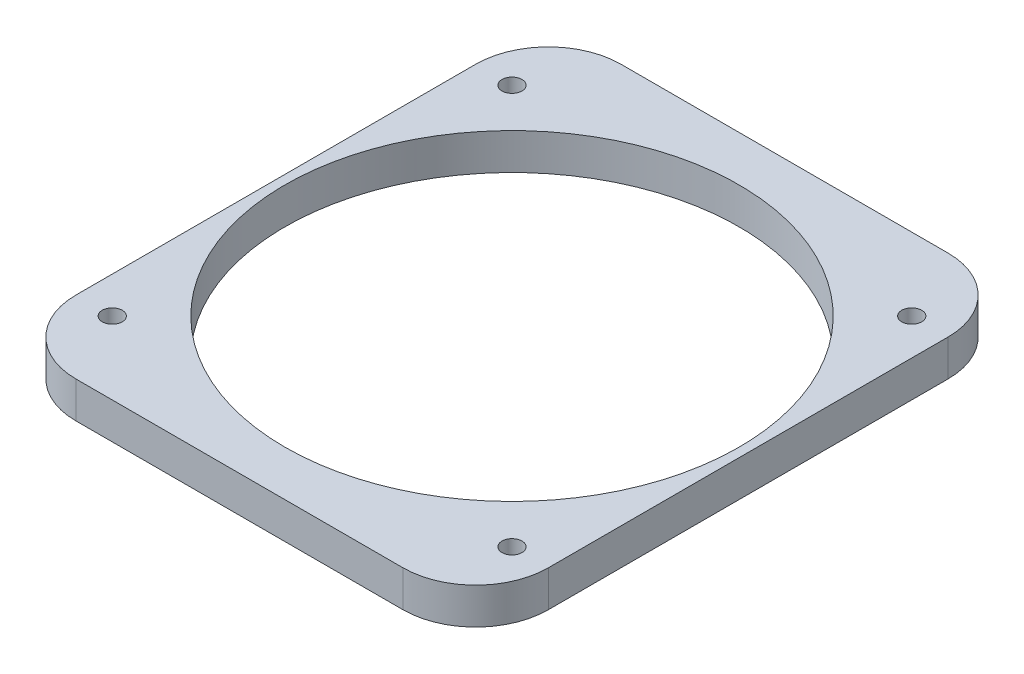
ISO-10303-21;
HEADER;
FILE_DESCRIPTION(('STEP AP214'),'2;1');
FILE_NAME('part.step','',(''),(''),'','','');
FILE_SCHEMA(('AUTOMOTIVE_DESIGN { 1 0 10303 214 1 1 1 1 }'));
ENDSEC;
DATA;
#1=APPLICATION_CONTEXT('core data for automotive mechanical design processes');
#2=APPLICATION_PROTOCOL_DEFINITION('international standard','automotive_design',2000,#1);
#3=PRODUCT_CONTEXT('',#1,'mechanical');
#4=PRODUCT('Part','Part','',(#3));
#5=PRODUCT_RELATED_PRODUCT_CATEGORY('part','',(#4));
#6=PRODUCT_DEFINITION_FORMATION('','',#4);
#7=PRODUCT_DEFINITION_CONTEXT('part definition',#1,'design');
#8=PRODUCT_DEFINITION('design','',#6,#7);
#9=PRODUCT_DEFINITION_SHAPE('','',#8);
#10=(LENGTH_UNIT() NAMED_UNIT(*) SI_UNIT(.MILLI.,.METRE.));
#11=(NAMED_UNIT(*) PLANE_ANGLE_UNIT() SI_UNIT($,.RADIAN.));
#12=(NAMED_UNIT(*) SI_UNIT($,.STERADIAN.) SOLID_ANGLE_UNIT());
#13=UNCERTAINTY_MEASURE_WITH_UNIT(LENGTH_MEASURE(1.E-05),#10,'distance_accuracy_value','');
#14=(GEOMETRIC_REPRESENTATION_CONTEXT(3) GLOBAL_UNCERTAINTY_ASSIGNED_CONTEXT((#13)) GLOBAL_UNIT_ASSIGNED_CONTEXT((#10,
#11,#12)) REPRESENTATION_CONTEXT('',''));
#15=CARTESIAN_POINT('',(0.,0.,0.));
#16=DIRECTION('',(0.,0.,1.));
#17=DIRECTION('',(1.,0.,0.));
#18=AXIS2_PLACEMENT_3D('',#15,#16,#17);
#19=CARTESIAN_POINT('',(0.,6.35,0.));
#20=DIRECTION('',(0.,1.,0.));
#21=DIRECTION('',(0.,0.,1.));
#22=AXIS2_PLACEMENT_3D('',#19,#20,#21);
#23=PLANE('',#22);
#24=CARTESIAN_POINT('',(0.,6.35,0.));
#25=DIRECTION('',(0.,1.,0.));
#26=DIRECTION('',(0.,0.,1.));
#27=AXIS2_PLACEMENT_3D('',#24,#25,#26);
#28=CIRCLE('',#27,39.6875);
#29=CARTESIAN_POINT('',(0.,6.35,39.6875));
#30=VERTEX_POINT('',#29);
#31=EDGE_CURVE('E201',#30,#30,#28,.T.);
#32=ORIENTED_EDGE('',*,*,#31,.F.);
#33=EDGE_LOOP('',(#32));
#34=FACE_BOUND('',#33,.T.);
#35=CARTESIAN_POINT('',(34.925,6.35,34.925));
#36=DIRECTION('',(0.,1.,0.));
#37=DIRECTION('',(0.,0.,1.));
#38=AXIS2_PLACEMENT_3D('',#35,#36,#37);
#39=CIRCLE('',#38,1.75);
#40=CARTESIAN_POINT('',(34.925,6.35,36.675));
#41=VERTEX_POINT('',#40);
#42=EDGE_CURVE('E186',#41,#41,#39,.T.);
#43=ORIENTED_EDGE('',*,*,#42,.F.);
#44=EDGE_LOOP('',(#43));
#45=FACE_BOUND('',#44,.T.);
#46=CARTESIAN_POINT('',(-34.925,6.35,-34.925));
#47=DIRECTION('',(0.,1.,0.));
#48=DIRECTION('',(0.,0.,1.));
#49=AXIS2_PLACEMENT_3D('',#46,#47,#48);
#50=CIRCLE('',#49,1.75);
#51=CARTESIAN_POINT('',(-34.925,6.35,-33.175));
#52=VERTEX_POINT('',#51);
#53=EDGE_CURVE('E127',#52,#52,#50,.T.);
#54=ORIENTED_EDGE('',*,*,#53,.F.);
#55=EDGE_LOOP('',(#54));
#56=FACE_BOUND('',#55,.T.);
#57=DIRECTION('',(-1.,0.,0.));
#58=VECTOR('',#57,1.);
#59=CARTESIAN_POINT('',(41.275,6.35,-47.625));
#60=LINE('',#59,#58);
#61=CARTESIAN_POINT('',(28.575,6.35,-47.625));
#62=VERTEX_POINT('',#61);
#63=CARTESIAN_POINT('',(-28.575,6.35,-47.625));
#64=VERTEX_POINT('',#63);
#65=EDGE_CURVE('E136',#62,#64,#60,.T.);
#66=ORIENTED_EDGE('',*,*,#65,.T.);
#67=CARTESIAN_POINT('',(-28.575,6.35,-34.925));
#68=DIRECTION('',(0.,1.,0.));
#69=DIRECTION('',(0.,0.,1.));
#70=AXIS2_PLACEMENT_3D('',#67,#68,#69);
#71=CIRCLE('',#70,12.7);
#72=CARTESIAN_POINT('',(-41.275,6.35,-34.925));
#73=VERTEX_POINT('',#72);
#74=EDGE_CURVE('E155',#64,#73,#71,.T.);
#75=ORIENTED_EDGE('',*,*,#74,.T.);
#76=DIRECTION('',(0.,0.,1.));
#77=VECTOR('',#76,1.);
#78=CARTESIAN_POINT('',(-41.275,6.35,47.625));
#79=LINE('',#78,#77);
#80=CARTESIAN_POINT('',(-41.275,6.35,34.925));
#81=VERTEX_POINT('',#80);
#82=EDGE_CURVE('E119',#73,#81,#79,.T.);
#83=ORIENTED_EDGE('',*,*,#82,.T.);
#84=CARTESIAN_POINT('',(-28.575,6.35,34.925));
#85=DIRECTION('',(0.,1.,0.));
#86=DIRECTION('',(0.,0.,1.));
#87=AXIS2_PLACEMENT_3D('',#84,#85,#86);
#88=CIRCLE('',#87,12.7);
#89=CARTESIAN_POINT('',(-28.575,6.35,47.625));
#90=VERTEX_POINT('',#89);
#91=EDGE_CURVE('E150',#81,#90,#88,.T.);
#92=ORIENTED_EDGE('',*,*,#91,.T.);
#93=DIRECTION('',(1.,0.,0.));
#94=VECTOR('',#93,1.);
#95=CARTESIAN_POINT('',(41.275,6.35,47.625));
#96=LINE('',#95,#94);
#97=CARTESIAN_POINT('',(28.575,6.35,47.625));
#98=VERTEX_POINT('',#97);
#99=EDGE_CURVE('E166',#90,#98,#96,.T.);
#100=ORIENTED_EDGE('',*,*,#99,.T.);
#101=CARTESIAN_POINT('',(28.575,6.35,34.925));
#102=DIRECTION('',(0.,1.,0.));
#103=DIRECTION('',(0.,0.,1.));
#104=AXIS2_PLACEMENT_3D('',#101,#102,#103);
#105=CIRCLE('',#104,12.7);
#106=CARTESIAN_POINT('',(41.275,6.35,34.925));
#107=VERTEX_POINT('',#106);
#108=EDGE_CURVE('E55',#98,#107,#105,.T.);
#109=ORIENTED_EDGE('',*,*,#108,.T.);
#110=DIRECTION('',(0.,0.,-1.));
#111=VECTOR('',#110,1.);
#112=CARTESIAN_POINT('',(41.275,6.35,47.625));
#113=LINE('',#112,#111);
#114=CARTESIAN_POINT('',(41.275,6.35,-34.925));
#115=VERTEX_POINT('',#114);
#116=EDGE_CURVE('E174',#107,#115,#113,.T.);
#117=ORIENTED_EDGE('',*,*,#116,.T.);
#118=CARTESIAN_POINT('',(28.575,6.35,-34.925));
#119=DIRECTION('',(0.,1.,0.));
#120=DIRECTION('',(0.,0.,1.));
#121=AXIS2_PLACEMENT_3D('',#118,#119,#120);
#122=CIRCLE('',#121,12.7);
#123=EDGE_CURVE('E153',#115,#62,#122,.T.);
#124=ORIENTED_EDGE('',*,*,#123,.T.);
#125=EDGE_LOOP('',(#66,#75,#83,#92,#100,#109,#117,#124));
#126=FACE_BOUND('',#125,.T.);
#127=CARTESIAN_POINT('',(-34.925,6.35,34.925));
#128=DIRECTION('',(0.,1.,0.));
#129=DIRECTION('',(0.,0.,1.));
#130=AXIS2_PLACEMENT_3D('',#127,#128,#129);
#131=CIRCLE('',#130,1.75);
#132=CARTESIAN_POINT('',(-34.925,6.35,36.675));
#133=VERTEX_POINT('',#132);
#134=EDGE_CURVE('E181',#133,#133,#131,.T.);
#135=ORIENTED_EDGE('',*,*,#134,.F.);
#136=EDGE_LOOP('',(#135));
#137=FACE_BOUND('',#136,.T.);
#138=CARTESIAN_POINT('',(34.925,6.35,-34.925));
#139=DIRECTION('',(0.,1.,0.));
#140=DIRECTION('',(0.,0.,1.));
#141=AXIS2_PLACEMENT_3D('',#138,#139,#140);
#142=CIRCLE('',#141,1.75);
#143=CARTESIAN_POINT('',(34.925,6.35,-33.175));
#144=VERTEX_POINT('',#143);
#145=EDGE_CURVE('E192',#144,#144,#142,.T.);
#146=ORIENTED_EDGE('',*,*,#145,.F.);
#147=EDGE_LOOP('',(#146));
#148=FACE_BOUND('',#147,.T.);
#149=ADVANCED_FACE('F33',(#34,#45,#56,#126,#137,#148),#23,.T.);
#150=CARTESIAN_POINT('',(0.,0.,0.));
#151=DIRECTION('',(0.,1.,0.));
#152=DIRECTION('',(0.,0.,1.));
#153=AXIS2_PLACEMENT_3D('',#150,#151,#152);
#154=PLANE('',#153);
#155=CARTESIAN_POINT('',(0.,0.,0.));
#156=DIRECTION('',(0.,1.,0.));
#157=DIRECTION('',(0.,0.,1.));
#158=AXIS2_PLACEMENT_3D('',#155,#156,#157);
#159=CIRCLE('',#158,39.6875);
#160=CARTESIAN_POINT('',(0.,0.,39.6875));
#161=VERTEX_POINT('',#160);
#162=EDGE_CURVE('E198',#161,#161,#159,.T.);
#163=ORIENTED_EDGE('',*,*,#162,.T.);
#164=EDGE_LOOP('',(#163));
#165=FACE_BOUND('',#164,.T.);
#166=CARTESIAN_POINT('',(34.925,0.,34.925));
#167=DIRECTION('',(0.,1.,0.));
#168=DIRECTION('',(0.,0.,1.));
#169=AXIS2_PLACEMENT_3D('',#166,#167,#168);
#170=CIRCLE('',#169,1.75);
#171=CARTESIAN_POINT('',(34.925,0.,36.675));
#172=VERTEX_POINT('',#171);
#173=EDGE_CURVE('E189',#172,#172,#170,.T.);
#174=ORIENTED_EDGE('',*,*,#173,.T.);
#175=EDGE_LOOP('',(#174));
#176=FACE_BOUND('',#175,.T.);
#177=CARTESIAN_POINT('',(-34.925,0.,-34.925));
#178=DIRECTION('',(0.,1.,0.));
#179=DIRECTION('',(0.,0.,1.));
#180=AXIS2_PLACEMENT_3D('',#177,#178,#179);
#181=CIRCLE('',#180,1.75);
#182=CARTESIAN_POINT('',(-34.925,0.,-33.175));
#183=VERTEX_POINT('',#182);
#184=EDGE_CURVE('E133',#183,#183,#181,.T.);
#185=ORIENTED_EDGE('',*,*,#184,.T.);
#186=EDGE_LOOP('',(#185));
#187=FACE_BOUND('',#186,.T.);
#188=DIRECTION('',(0.,0.,1.));
#189=VECTOR('',#188,1.);
#190=CARTESIAN_POINT('',(-41.275,0.,47.625));
#191=LINE('',#190,#189);
#192=CARTESIAN_POINT('',(-41.275,0.,-34.925));
#193=VERTEX_POINT('',#192);
#194=CARTESIAN_POINT('',(-41.275,0.,34.925));
#195=VERTEX_POINT('',#194);
#196=EDGE_CURVE('E116',#193,#195,#191,.T.);
#197=ORIENTED_EDGE('',*,*,#196,.F.);
#198=CARTESIAN_POINT('',(-28.575,0.,-34.925));
#199=DIRECTION('',(0.,1.,0.));
#200=DIRECTION('',(0.,0.,1.));
#201=AXIS2_PLACEMENT_3D('',#198,#199,#200);
#202=CIRCLE('',#201,12.7);
#203=CARTESIAN_POINT('',(-28.575,0.,-47.625));
#204=VERTEX_POINT('',#203);
#205=EDGE_CURVE('E99',#193,#204,#202,.F.);
#206=ORIENTED_EDGE('',*,*,#205,.T.);
#207=DIRECTION('',(-1.,0.,0.));
#208=VECTOR('',#207,1.);
#209=CARTESIAN_POINT('',(41.275,0.,-47.625));
#210=LINE('',#209,#208);
#211=CARTESIAN_POINT('',(28.575,0.,-47.625));
#212=VERTEX_POINT('',#211);
#213=EDGE_CURVE('E140',#212,#204,#210,.T.);
#214=ORIENTED_EDGE('',*,*,#213,.F.);
#215=CARTESIAN_POINT('',(28.575,0.,-34.925));
#216=DIRECTION('',(0.,1.,0.));
#217=DIRECTION('',(0.,0.,1.));
#218=AXIS2_PLACEMENT_3D('',#215,#216,#217);
#219=CIRCLE('',#218,12.7);
#220=CARTESIAN_POINT('',(41.275,0.,-34.925));
#221=VERTEX_POINT('',#220);
#222=EDGE_CURVE('E110',#212,#221,#219,.F.);
#223=ORIENTED_EDGE('',*,*,#222,.T.);
#224=DIRECTION('',(0.,0.,-1.));
#225=VECTOR('',#224,1.);
#226=CARTESIAN_POINT('',(41.275,0.,47.625));
#227=LINE('',#226,#225);
#228=CARTESIAN_POINT('',(41.275,0.,34.925));
#229=VERTEX_POINT('',#228);
#230=EDGE_CURVE('E130',#229,#221,#227,.T.);
#231=ORIENTED_EDGE('',*,*,#230,.F.);
#232=CARTESIAN_POINT('',(28.575,0.,34.925));
#233=DIRECTION('',(0.,1.,0.));
#234=DIRECTION('',(0.,0.,1.));
#235=AXIS2_PLACEMENT_3D('',#232,#233,#234);
#236=CIRCLE('',#235,12.7);
#237=CARTESIAN_POINT('',(28.575,0.,47.625));
#238=VERTEX_POINT('',#237);
#239=EDGE_CURVE('E144',#229,#238,#236,.F.);
#240=ORIENTED_EDGE('',*,*,#239,.T.);
#241=DIRECTION('',(1.,0.,0.));
#242=VECTOR('',#241,1.);
#243=CARTESIAN_POINT('',(41.275,0.,47.625));
#244=LINE('',#243,#242);
#245=CARTESIAN_POINT('',(-28.575,0.,47.625));
#246=VERTEX_POINT('',#245);
#247=EDGE_CURVE('E126',#246,#238,#244,.T.);
#248=ORIENTED_EDGE('',*,*,#247,.F.);
#249=CARTESIAN_POINT('',(-28.575,0.,34.925));
#250=DIRECTION('',(0.,1.,0.));
#251=DIRECTION('',(0.,0.,1.));
#252=AXIS2_PLACEMENT_3D('',#249,#250,#251);
#253=CIRCLE('',#252,12.7);
#254=EDGE_CURVE('E120',#246,#195,#253,.F.);
#255=ORIENTED_EDGE('',*,*,#254,.T.);
#256=EDGE_LOOP('',(#197,#206,#214,#223,#231,#240,#248,#255));
#257=FACE_BOUND('',#256,.T.);
#258=CARTESIAN_POINT('',(-34.925,0.,34.925));
#259=DIRECTION('',(0.,1.,0.));
#260=DIRECTION('',(0.,0.,1.));
#261=AXIS2_PLACEMENT_3D('',#258,#259,#260);
#262=CIRCLE('',#261,1.75);
#263=CARTESIAN_POINT('',(-34.925,0.,36.675));
#264=VERTEX_POINT('',#263);
#265=EDGE_CURVE('E183',#264,#264,#262,.T.);
#266=ORIENTED_EDGE('',*,*,#265,.T.);
#267=EDGE_LOOP('',(#266));
#268=FACE_BOUND('',#267,.T.);
#269=CARTESIAN_POINT('',(34.925,0.,-34.925));
#270=DIRECTION('',(0.,1.,0.));
#271=DIRECTION('',(0.,0.,1.));
#272=AXIS2_PLACEMENT_3D('',#269,#270,#271);
#273=CIRCLE('',#272,1.75);
#274=CARTESIAN_POINT('',(34.925,0.,-33.175));
#275=VERTEX_POINT('',#274);
#276=EDGE_CURVE('E195',#275,#275,#273,.T.);
#277=ORIENTED_EDGE('',*,*,#276,.T.);
#278=EDGE_LOOP('',(#277));
#279=FACE_BOUND('',#278,.T.);
#280=ADVANCED_FACE('F123',(#165,#176,#187,#257,#268,#279),#154,.F.);
#281=CARTESIAN_POINT('',(-41.275,6.35,47.625));
#282=DIRECTION('',(1.,0.,0.));
#283=DIRECTION('',(0.,0.,-1.));
#284=AXIS2_PLACEMENT_3D('',#281,#282,#283);
#285=PLANE('',#284);
#286=ORIENTED_EDGE('',*,*,#82,.F.);
#287=DIRECTION('',(0.,-1.,0.));
#288=VECTOR('',#287,1.);
#289=CARTESIAN_POINT('',(-41.275,6.35,-34.925));
#290=LINE('',#289,#288);
#291=EDGE_CURVE('E103',#73,#193,#290,.T.);
#292=ORIENTED_EDGE('',*,*,#291,.T.);
#293=ORIENTED_EDGE('',*,*,#196,.T.);
#294=DIRECTION('',(0.,-1.,0.));
#295=VECTOR('',#294,1.);
#296=CARTESIAN_POINT('',(-41.275,6.35,34.925));
#297=LINE('',#296,#295);
#298=EDGE_CURVE('E121',#195,#81,#297,.F.);
#299=ORIENTED_EDGE('',*,*,#298,.T.);
#300=EDGE_LOOP('',(#286,#292,#293,#299));
#301=FACE_BOUND('',#300,.T.);
#302=ADVANCED_FACE('F115',(#301),#285,.F.);
#303=CARTESIAN_POINT('',(41.275,6.35,47.625));
#304=DIRECTION('',(0.,0.,-1.));
#305=DIRECTION('',(-1.,0.,0.));
#306=AXIS2_PLACEMENT_3D('',#303,#304,#305);
#307=PLANE('',#306);
#308=ORIENTED_EDGE('',*,*,#247,.T.);
#309=DIRECTION('',(0.,-1.,0.));
#310=VECTOR('',#309,1.);
#311=CARTESIAN_POINT('',(28.575,6.35,47.625));
#312=LINE('',#311,#310);
#313=EDGE_CURVE('E11',#238,#98,#312,.F.);
#314=ORIENTED_EDGE('',*,*,#313,.T.);
#315=ORIENTED_EDGE('',*,*,#99,.F.);
#316=DIRECTION('',(0.,-1.,0.));
#317=VECTOR('',#316,1.);
#318=CARTESIAN_POINT('',(-28.575,6.35,47.625));
#319=LINE('',#318,#317);
#320=EDGE_CURVE('E41',#90,#246,#319,.T.);
#321=ORIENTED_EDGE('',*,*,#320,.T.);
#322=EDGE_LOOP('',(#308,#314,#315,#321));
#323=FACE_BOUND('',#322,.T.);
#324=ADVANCED_FACE('F164',(#323),#307,.F.);
#325=CARTESIAN_POINT('',(41.275,6.35,47.625));
#326=DIRECTION('',(-1.,0.,0.));
#327=DIRECTION('',(0.,0.,1.));
#328=AXIS2_PLACEMENT_3D('',#325,#326,#327);
#329=PLANE('',#328);
#330=ORIENTED_EDGE('',*,*,#230,.T.);
#331=DIRECTION('',(0.,-1.,0.));
#332=VECTOR('',#331,1.);
#333=CARTESIAN_POINT('',(41.275,6.35,-34.925));
#334=LINE('',#333,#332);
#335=EDGE_CURVE('E48',#221,#115,#334,.F.);
#336=ORIENTED_EDGE('',*,*,#335,.T.);
#337=ORIENTED_EDGE('',*,*,#116,.F.);
#338=DIRECTION('',(0.,-1.,0.));
#339=VECTOR('',#338,1.);
#340=CARTESIAN_POINT('',(41.275,6.35,34.925));
#341=LINE('',#340,#339);
#342=EDGE_CURVE('E157',#107,#229,#341,.T.);
#343=ORIENTED_EDGE('',*,*,#342,.T.);
#344=EDGE_LOOP('',(#330,#336,#337,#343));
#345=FACE_BOUND('',#344,.T.);
#346=ADVANCED_FACE('F173',(#345),#329,.F.);
#347=CARTESIAN_POINT('',(41.275,6.35,-47.625));
#348=DIRECTION('',(0.,0.,1.));
#349=DIRECTION('',(1.,0.,0.));
#350=AXIS2_PLACEMENT_3D('',#347,#348,#349);
#351=PLANE('',#350);
#352=ORIENTED_EDGE('',*,*,#213,.T.);
#353=DIRECTION('',(0.,-1.,0.));
#354=VECTOR('',#353,1.);
#355=CARTESIAN_POINT('',(-28.575,6.35,-47.625));
#356=LINE('',#355,#354);
#357=EDGE_CURVE('E104',#204,#64,#356,.F.);
#358=ORIENTED_EDGE('',*,*,#357,.T.);
#359=ORIENTED_EDGE('',*,*,#65,.F.);
#360=DIRECTION('',(0.,-1.,0.));
#361=VECTOR('',#360,1.);
#362=CARTESIAN_POINT('',(28.575,6.35,-47.625));
#363=LINE('',#362,#361);
#364=EDGE_CURVE('E109',#62,#212,#363,.T.);
#365=ORIENTED_EDGE('',*,*,#364,.T.);
#366=EDGE_LOOP('',(#352,#358,#359,#365));
#367=FACE_BOUND('',#366,.T.);
#368=ADVANCED_FACE('F243',(#367),#351,.F.);
#369=CARTESIAN_POINT('',(-34.925,6.35,-34.925));
#370=DIRECTION('',(0.,-1.,0.));
#371=DIRECTION('',(0.,0.,-1.));
#372=AXIS2_PLACEMENT_3D('',#369,#370,#371);
#373=CYLINDRICAL_SURFACE('',#372,1.75);
#374=ORIENTED_EDGE('',*,*,#53,.T.);
#375=EDGE_LOOP('',(#374));
#376=FACE_BOUND('',#375,.T.);
#377=ORIENTED_EDGE('',*,*,#184,.F.);
#378=EDGE_LOOP('',(#377));
#379=FACE_BOUND('',#378,.T.);
#380=ADVANCED_FACE('F246',(#376,#379),#373,.F.);
#381=CARTESIAN_POINT('',(-34.925,6.35,34.925));
#382=DIRECTION('',(0.,-1.,0.));
#383=DIRECTION('',(0.,0.,-1.));
#384=AXIS2_PLACEMENT_3D('',#381,#382,#383);
#385=CYLINDRICAL_SURFACE('',#384,1.75);
#386=ORIENTED_EDGE('',*,*,#134,.T.);
#387=EDGE_LOOP('',(#386));
#388=FACE_BOUND('',#387,.T.);
#389=ORIENTED_EDGE('',*,*,#265,.F.);
#390=EDGE_LOOP('',(#389));
#391=FACE_BOUND('',#390,.T.);
#392=ADVANCED_FACE('F297',(#388,#391),#385,.F.);
#393=CARTESIAN_POINT('',(34.925,6.35,34.925));
#394=DIRECTION('',(0.,-1.,0.));
#395=DIRECTION('',(0.,0.,-1.));
#396=AXIS2_PLACEMENT_3D('',#393,#394,#395);
#397=CYLINDRICAL_SURFACE('',#396,1.75);
#398=ORIENTED_EDGE('',*,*,#42,.T.);
#399=EDGE_LOOP('',(#398));
#400=FACE_BOUND('',#399,.T.);
#401=ORIENTED_EDGE('',*,*,#173,.F.);
#402=EDGE_LOOP('',(#401));
#403=FACE_BOUND('',#402,.T.);
#404=ADVANCED_FACE('F230',(#400,#403),#397,.F.);
#405=CARTESIAN_POINT('',(34.925,6.35,-34.925));
#406=DIRECTION('',(0.,-1.,0.));
#407=DIRECTION('',(0.,0.,-1.));
#408=AXIS2_PLACEMENT_3D('',#405,#406,#407);
#409=CYLINDRICAL_SURFACE('',#408,1.75);
#410=ORIENTED_EDGE('',*,*,#145,.T.);
#411=EDGE_LOOP('',(#410));
#412=FACE_BOUND('',#411,.T.);
#413=ORIENTED_EDGE('',*,*,#276,.F.);
#414=EDGE_LOOP('',(#413));
#415=FACE_BOUND('',#414,.T.);
#416=ADVANCED_FACE('F227',(#412,#415),#409,.F.);
#417=CARTESIAN_POINT('',(-28.575,6.35,-34.925));
#418=DIRECTION('',(0.,-1.,0.));
#419=DIRECTION('',(0.,0.,-1.));
#420=AXIS2_PLACEMENT_3D('',#417,#418,#419);
#421=CYLINDRICAL_SURFACE('',#420,12.7);
#422=ORIENTED_EDGE('',*,*,#74,.F.);
#423=ORIENTED_EDGE('',*,*,#357,.F.);
#424=ORIENTED_EDGE('',*,*,#205,.F.);
#425=ORIENTED_EDGE('',*,*,#291,.F.);
#426=EDGE_LOOP('',(#422,#423,#424,#425));
#427=FACE_BOUND('',#426,.T.);
#428=ADVANCED_FACE('F102',(#427),#421,.T.);
#429=CARTESIAN_POINT('',(28.575,6.35,-34.925));
#430=DIRECTION('',(0.,-1.,0.));
#431=DIRECTION('',(0.,0.,-1.));
#432=AXIS2_PLACEMENT_3D('',#429,#430,#431);
#433=CYLINDRICAL_SURFACE('',#432,12.7);
#434=ORIENTED_EDGE('',*,*,#123,.F.);
#435=ORIENTED_EDGE('',*,*,#335,.F.);
#436=ORIENTED_EDGE('',*,*,#222,.F.);
#437=ORIENTED_EDGE('',*,*,#364,.F.);
#438=EDGE_LOOP('',(#434,#435,#436,#437));
#439=FACE_BOUND('',#438,.T.);
#440=ADVANCED_FACE('F254',(#439),#433,.T.);
#441=CARTESIAN_POINT('',(28.575,6.35,34.925));
#442=DIRECTION('',(0.,-1.,0.));
#443=DIRECTION('',(0.,0.,-1.));
#444=AXIS2_PLACEMENT_3D('',#441,#442,#443);
#445=CYLINDRICAL_SURFACE('',#444,12.7);
#446=ORIENTED_EDGE('',*,*,#108,.F.);
#447=ORIENTED_EDGE('',*,*,#313,.F.);
#448=ORIENTED_EDGE('',*,*,#239,.F.);
#449=ORIENTED_EDGE('',*,*,#342,.F.);
#450=EDGE_LOOP('',(#446,#447,#448,#449));
#451=FACE_BOUND('',#450,.T.);
#452=ADVANCED_FACE('F172',(#451),#445,.T.);
#453=CARTESIAN_POINT('',(-28.575,6.35,34.925));
#454=DIRECTION('',(0.,-1.,0.));
#455=DIRECTION('',(0.,0.,-1.));
#456=AXIS2_PLACEMENT_3D('',#453,#454,#455);
#457=CYLINDRICAL_SURFACE('',#456,12.7);
#458=ORIENTED_EDGE('',*,*,#91,.F.);
#459=ORIENTED_EDGE('',*,*,#298,.F.);
#460=ORIENTED_EDGE('',*,*,#254,.F.);
#461=ORIENTED_EDGE('',*,*,#320,.F.);
#462=EDGE_LOOP('',(#458,#459,#460,#461));
#463=FACE_BOUND('',#462,.T.);
#464=ADVANCED_FACE('F35',(#463),#457,.T.);
#465=CARTESIAN_POINT('',(0.,0.,0.));
#466=DIRECTION('',(0.,1.,0.));
#467=DIRECTION('',(0.,0.,1.));
#468=AXIS2_PLACEMENT_3D('',#465,#466,#467);
#469=CYLINDRICAL_SURFACE('',#468,39.6875);
#470=ORIENTED_EDGE('',*,*,#162,.F.);
#471=EDGE_LOOP('',(#470));
#472=FACE_BOUND('',#471,.T.);
#473=ORIENTED_EDGE('',*,*,#31,.T.);
#474=EDGE_LOOP('',(#473));
#475=FACE_BOUND('',#474,.T.);
#476=ADVANCED_FACE('F209',(#472,#475),#469,.F.);
#477=CLOSED_SHELL('',(#149,#280,#302,#324,#346,#368,#380,#392,#404,#416,#428,#440,#452,#464,#476));
#478=MANIFOLD_SOLID_BREP('B2',#477);
#479=ADVANCED_BREP_SHAPE_REPRESENTATION('',(#18,#478),#14);
#480=SHAPE_DEFINITION_REPRESENTATION(#9,#479);
ENDSEC;
END-ISO-10303-21;
